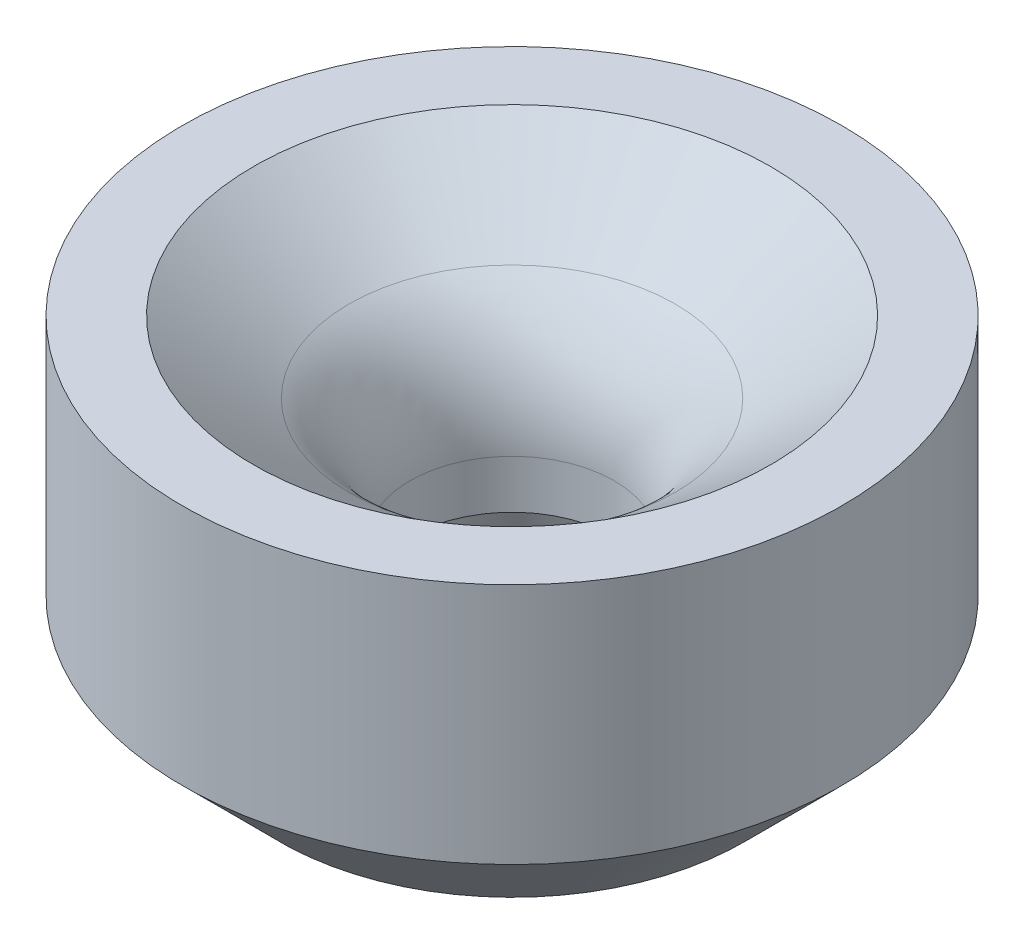
ISO-10303-21;
HEADER;
FILE_DESCRIPTION(('STEP AP214'),'2;1');
FILE_NAME('part.step','',(''),(''),'','','');
FILE_SCHEMA(('AUTOMOTIVE_DESIGN { 1 0 10303 214 1 1 1 1 }'));
ENDSEC;
DATA;
#1=APPLICATION_CONTEXT('core data for automotive mechanical design processes');
#2=APPLICATION_PROTOCOL_DEFINITION('international standard','automotive_design',2000,#1);
#3=PRODUCT_CONTEXT('',#1,'mechanical');
#4=PRODUCT('Part','Part','',(#3));
#5=PRODUCT_RELATED_PRODUCT_CATEGORY('part','',(#4));
#6=PRODUCT_DEFINITION_FORMATION('','',#4);
#7=PRODUCT_DEFINITION_CONTEXT('part definition',#1,'design');
#8=PRODUCT_DEFINITION('design','',#6,#7);
#9=PRODUCT_DEFINITION_SHAPE('','',#8);
#10=(LENGTH_UNIT() NAMED_UNIT(*) SI_UNIT(.MILLI.,.METRE.));
#11=(NAMED_UNIT(*) PLANE_ANGLE_UNIT() SI_UNIT($,.RADIAN.));
#12=(NAMED_UNIT(*) SI_UNIT($,.STERADIAN.) SOLID_ANGLE_UNIT());
#13=UNCERTAINTY_MEASURE_WITH_UNIT(LENGTH_MEASURE(1.E-05),#10,'distance_accuracy_value','');
#14=(GEOMETRIC_REPRESENTATION_CONTEXT(3) GLOBAL_UNCERTAINTY_ASSIGNED_CONTEXT((#13)) GLOBAL_UNIT_ASSIGNED_CONTEXT((#10,
#11,#12)) REPRESENTATION_CONTEXT('',''));
#15=CARTESIAN_POINT('',(0.,0.,0.));
#16=DIRECTION('',(0.,0.,1.));
#17=DIRECTION('',(1.,0.,0.));
#18=AXIS2_PLACEMENT_3D('',#15,#16,#17);
#19=CARTESIAN_POINT('',(0.,0.,0.));
#20=DIRECTION('',(0.,-1.,0.));
#21=DIRECTION('',(0.,0.,-1.));
#22=AXIS2_PLACEMENT_3D('',#19,#20,#21);
#23=TOROIDAL_SURFACE('',#22,16.7005,10.0203);
#24=CARTESIAN_POINT('',(0.,8.01622925972647,0.));
#25=DIRECTION('',(0.,-1.,0.));
#26=DIRECTION('',(0.,0.,-1.));
#27=AXIS2_PLACEMENT_3D('',#24,#25,#26);
#28=CIRCLE('',#27,10.6883056796619);
#29=CARTESIAN_POINT('',(0.,8.01622925972647,-10.6883056796619));
#30=VERTEX_POINT('',#29);
#31=EDGE_CURVE('E10',#30,#30,#28,.T.);
#32=ORIENTED_EDGE('',*,*,#31,.F.);
#33=EDGE_LOOP('',(#32));
#34=FACE_BOUND('',#33,.T.);
#35=CARTESIAN_POINT('',(0.,0.,0.));
#36=DIRECTION('',(0.,-1.,0.));
#37=DIRECTION('',(0.,0.,-1.));
#38=AXIS2_PLACEMENT_3D('',#35,#36,#37);
#39=CIRCLE('',#38,6.6802);
#40=CARTESIAN_POINT('',(0.,0.,-6.6802));
#41=VERTEX_POINT('',#40);
#42=EDGE_CURVE('E64',#41,#41,#39,.T.);
#43=ORIENTED_EDGE('',*,*,#42,.T.);
#44=EDGE_LOOP('',(#43));
#45=FACE_BOUND('',#44,.T.);
#46=ADVANCED_FACE('F36',(#34,#45),#23,.T.);
#47=CARTESIAN_POINT('',(0.,8.01622925972647,0.));
#48=DIRECTION('',(0.,1.,0.));
#49=DIRECTION('',(0.,0.,1.));
#50=AXIS2_PLACEMENT_3D('',#47,#48,#49);
#51=CONICAL_SURFACE('',#50,10.6883056796619,0.927293431584583);
#52=CARTESIAN_POINT('',(0.,12.7,0.));
#53=DIRECTION('',(0.,-1.,0.));
#54=DIRECTION('',(0.,0.,-1.));
#55=AXIS2_PLACEMENT_3D('',#52,#53,#54);
#56=CIRCLE('',#55,16.9333100912825);
#57=CARTESIAN_POINT('',(0.,12.7,-16.9333100912825));
#58=VERTEX_POINT('',#57);
#59=EDGE_CURVE('E42',#58,#58,#56,.T.);
#60=ORIENTED_EDGE('',*,*,#59,.F.);
#61=EDGE_LOOP('',(#60));
#62=FACE_BOUND('',#61,.T.);
#63=ORIENTED_EDGE('',*,*,#31,.T.);
#64=EDGE_LOOP('',(#63));
#65=FACE_BOUND('',#64,.T.);
#66=ADVANCED_FACE('F101',(#62,#65),#51,.F.);
#67=CARTESIAN_POINT('',(-21.59,12.7,0.));
#68=DIRECTION('',(0.,-1.,0.));
#69=DIRECTION('',(0.,0.,-1.));
#70=AXIS2_PLACEMENT_3D('',#67,#68,#69);
#71=PLANE('',#70);
#72=CARTESIAN_POINT('',(0.,12.7,0.));
#73=DIRECTION('',(0.,-1.,0.));
#74=DIRECTION('',(0.,0.,-1.));
#75=AXIS2_PLACEMENT_3D('',#72,#73,#74);
#76=CIRCLE('',#75,21.59);
#77=CARTESIAN_POINT('',(0.,12.7,-21.59));
#78=VERTEX_POINT('',#77);
#79=EDGE_CURVE('E46',#78,#78,#76,.T.);
#80=ORIENTED_EDGE('',*,*,#79,.F.);
#81=EDGE_LOOP('',(#80));
#82=FACE_BOUND('',#81,.T.);
#83=ORIENTED_EDGE('',*,*,#59,.T.);
#84=EDGE_LOOP('',(#83));
#85=FACE_BOUND('',#84,.T.);
#86=ADVANCED_FACE('F96',(#82,#85),#71,.F.);
#87=CARTESIAN_POINT('',(0.,0.,0.));
#88=DIRECTION('',(0.,-1.,0.));
#89=DIRECTION('',(0.,0.,-1.));
#90=AXIS2_PLACEMENT_3D('',#87,#88,#89);
#91=CYLINDRICAL_SURFACE('',#90,21.59);
#92=CARTESIAN_POINT('',(0.,-3.17500000000008,0.));
#93=DIRECTION('',(0.,-1.,0.));
#94=DIRECTION('',(0.,0.,-1.));
#95=AXIS2_PLACEMENT_3D('',#92,#93,#94);
#96=CIRCLE('',#95,21.59);
#97=CARTESIAN_POINT('',(0.,-3.17500000000008,-21.59));
#98=VERTEX_POINT('',#97);
#99=EDGE_CURVE('E50',#98,#98,#96,.T.);
#100=ORIENTED_EDGE('',*,*,#99,.F.);
#101=EDGE_LOOP('',(#100));
#102=FACE_BOUND('',#101,.T.);
#103=ORIENTED_EDGE('',*,*,#79,.T.);
#104=EDGE_LOOP('',(#103));
#105=FACE_BOUND('',#104,.T.);
#106=ADVANCED_FACE('F90',(#102,#105),#91,.T.);
#107=CARTESIAN_POINT('',(0.,-3.17500000000008,0.));
#108=DIRECTION('',(0.,1.,0.));
#109=DIRECTION('',(0.,0.,1.));
#110=AXIS2_PLACEMENT_3D('',#107,#108,#109);
#111=CONICAL_SURFACE('',#110,21.59,0.785398163397454);
#112=CARTESIAN_POINT('',(0.,-9.525,0.));
#113=DIRECTION('',(0.,-1.,0.));
#114=DIRECTION('',(0.,0.,-1.));
#115=AXIS2_PLACEMENT_3D('',#112,#113,#114);
#116=CIRCLE('',#115,15.24);
#117=CARTESIAN_POINT('',(0.,-9.525,-15.24));
#118=VERTEX_POINT('',#117);
#119=EDGE_CURVE('E55',#118,#118,#116,.T.);
#120=ORIENTED_EDGE('',*,*,#119,.F.);
#121=EDGE_LOOP('',(#120));
#122=FACE_BOUND('',#121,.T.);
#123=ORIENTED_EDGE('',*,*,#99,.T.);
#124=EDGE_LOOP('',(#123));
#125=FACE_BOUND('',#124,.T.);
#126=ADVANCED_FACE('F84',(#122,#125),#111,.T.);
#127=CARTESIAN_POINT('',(-8.62158982726245,-9.525,0.));
#128=DIRECTION('',(0.,1.,0.));
#129=DIRECTION('',(0.,0.,1.));
#130=AXIS2_PLACEMENT_3D('',#127,#128,#129);
#131=PLANE('',#130);
#132=CARTESIAN_POINT('',(0.,-9.525,0.));
#133=DIRECTION('',(0.,-1.,0.));
#134=DIRECTION('',(0.,0.,-1.));
#135=AXIS2_PLACEMENT_3D('',#132,#133,#134);
#136=CIRCLE('',#135,8.62158982726245);
#137=CARTESIAN_POINT('',(0.,-9.525,-8.62158982726245));
#138=VERTEX_POINT('',#137);
#139=EDGE_CURVE('E58',#138,#138,#136,.T.);
#140=ORIENTED_EDGE('',*,*,#139,.F.);
#141=EDGE_LOOP('',(#140));
#142=FACE_BOUND('',#141,.T.);
#143=ORIENTED_EDGE('',*,*,#119,.T.);
#144=EDGE_LOOP('',(#143));
#145=FACE_BOUND('',#144,.T.);
#146=ADVANCED_FACE('F78',(#142,#145),#131,.F.);
#147=CARTESIAN_POINT('',(0.,-9.525,0.));
#148=DIRECTION('',(0.,-1.,0.));
#149=DIRECTION('',(0.,0.,-1.));
#150=AXIS2_PLACEMENT_3D('',#147,#148,#149);
#151=CONICAL_SURFACE('',#150,8.62158982726245,0.29670597283903);
#152=CARTESIAN_POINT('',(0.,-3.175,0.));
#153=DIRECTION('',(0.,-1.,0.));
#154=DIRECTION('',(0.,0.,-1.));
#155=AXIS2_PLACEMENT_3D('',#152,#153,#154);
#156=CIRCLE('',#155,6.6802);
#157=CARTESIAN_POINT('',(0.,-3.175,-6.6802));
#158=VERTEX_POINT('',#157);
#159=EDGE_CURVE('E61',#158,#158,#156,.T.);
#160=ORIENTED_EDGE('',*,*,#159,.F.);
#161=EDGE_LOOP('',(#160));
#162=FACE_BOUND('',#161,.T.);
#163=ORIENTED_EDGE('',*,*,#139,.T.);
#164=EDGE_LOOP('',(#163));
#165=FACE_BOUND('',#164,.T.);
#166=ADVANCED_FACE('F72',(#162,#165),#151,.F.);
#167=CARTESIAN_POINT('',(0.,0.,0.));
#168=DIRECTION('',(0.,-1.,0.));
#169=DIRECTION('',(0.,0.,-1.));
#170=AXIS2_PLACEMENT_3D('',#167,#168,#169);
#171=CYLINDRICAL_SURFACE('',#170,6.6802);
#172=ORIENTED_EDGE('',*,*,#42,.F.);
#173=EDGE_LOOP('',(#172));
#174=FACE_BOUND('',#173,.T.);
#175=ORIENTED_EDGE('',*,*,#159,.T.);
#176=EDGE_LOOP('',(#175));
#177=FACE_BOUND('',#176,.T.);
#178=ADVANCED_FACE('F69',(#174,#177),#171,.F.);
#179=CLOSED_SHELL('',(#46,#66,#86,#106,#126,#146,#166,#178));
#180=MANIFOLD_SOLID_BREP('B2',#179);
#181=ADVANCED_BREP_SHAPE_REPRESENTATION('',(#18,#180),#14);
#182=SHAPE_DEFINITION_REPRESENTATION(#9,#181);
ENDSEC;
END-ISO-10303-21;
